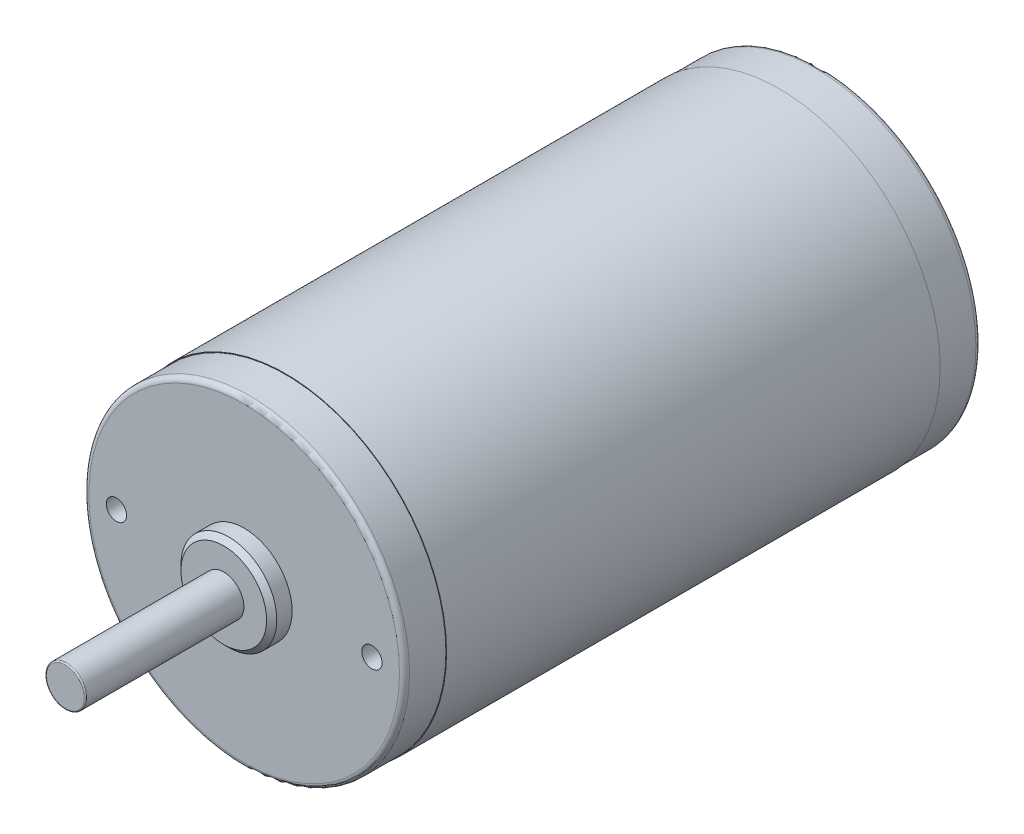
ISO-10303-21;
HEADER;
FILE_DESCRIPTION(('STEP AP214'),'2;1');
FILE_NAME('part.step','',(''),(''),'','','');
FILE_SCHEMA(('AUTOMOTIVE_DESIGN { 1 0 10303 214 1 1 1 1 }'));
ENDSEC;
DATA;
#1=APPLICATION_CONTEXT('core data for automotive mechanical design processes');
#2=APPLICATION_PROTOCOL_DEFINITION('international standard','automotive_design',2000,#1);
#3=PRODUCT_CONTEXT('',#1,'mechanical');
#4=PRODUCT('Part','Part','',(#3));
#5=PRODUCT_RELATED_PRODUCT_CATEGORY('part','',(#4));
#6=PRODUCT_DEFINITION_FORMATION('','',#4);
#7=PRODUCT_DEFINITION_CONTEXT('part definition',#1,'design');
#8=PRODUCT_DEFINITION('design','',#6,#7);
#9=PRODUCT_DEFINITION_SHAPE('','',#8);
#10=(LENGTH_UNIT() NAMED_UNIT(*) SI_UNIT(.MILLI.,.METRE.));
#11=(NAMED_UNIT(*) PLANE_ANGLE_UNIT() SI_UNIT($,.RADIAN.));
#12=(NAMED_UNIT(*) SI_UNIT($,.STERADIAN.) SOLID_ANGLE_UNIT());
#13=UNCERTAINTY_MEASURE_WITH_UNIT(LENGTH_MEASURE(1.E-05),#10,'distance_accuracy_value','');
#14=(GEOMETRIC_REPRESENTATION_CONTEXT(3) GLOBAL_UNCERTAINTY_ASSIGNED_CONTEXT((#13)) GLOBAL_UNIT_ASSIGNED_CONTEXT((#10,
#11,#12)) REPRESENTATION_CONTEXT('',''));
#15=CARTESIAN_POINT('',(0.,0.,0.));
#16=DIRECTION('',(0.,0.,1.));
#17=DIRECTION('',(1.,0.,0.));
#18=AXIS2_PLACEMENT_3D('',#15,#16,#17);
#19=CARTESIAN_POINT('',(35.56,109.2962,-95.554799999998));
#20=DIRECTION('',(0.,0.,-1.));
#21=DIRECTION('',(-1.,0.,0.));
#22=AXIS2_PLACEMENT_3D('',#19,#20,#21);
#23=PLANE('',#22);
#24=CARTESIAN_POINT('',(35.56,109.2962,-95.554799999998));
#25=DIRECTION('',(0.,0.,-1.));
#26=DIRECTION('',(-1.,0.,0.));
#27=AXIS2_PLACEMENT_3D('',#24,#25,#26);
#28=CIRCLE('',#27,30.8770000000005);
#29=CARTESIAN_POINT('',(4.6829999999995,109.2962,-95.554799999998));
#30=VERTEX_POINT('',#29);
#31=EDGE_CURVE('E126',#30,#30,#28,.T.);
#32=ORIENTED_EDGE('',*,*,#31,.T.);
#33=EDGE_LOOP('',(#32));
#34=FACE_BOUND('',#33,.T.);
#35=CARTESIAN_POINT('',(35.56,109.2962,-95.554799999998));
#36=DIRECTION('',(0.,0.,-1.));
#37=DIRECTION('',(-1.,0.,0.));
#38=AXIS2_PLACEMENT_3D('',#35,#36,#37);
#39=CIRCLE('',#38,15.0368000000003);
#40=CARTESIAN_POINT('',(20.5231999999997,109.2962,-95.554799999998));
#41=VERTEX_POINT('',#40);
#42=EDGE_CURVE('E83',#41,#41,#39,.T.);
#43=ORIENTED_EDGE('',*,*,#42,.F.);
#44=EDGE_LOOP('',(#43));
#45=FACE_BOUND('',#44,.T.);
#46=ADVANCED_FACE('F40',(#34,#45),#23,.T.);
#47=CARTESIAN_POINT('',(35.56,109.2962,-87.325199999998));
#48=DIRECTION('',(0.,0.,-1.));
#49=DIRECTION('',(-1.,0.,0.));
#50=AXIS2_PLACEMENT_3D('',#47,#48,#49);
#51=PLANE('',#50);
#52=CARTESIAN_POINT('',(35.56,109.2962,-87.325199999998));
#53=DIRECTION('',(0.,0.,-1.));
#54=DIRECTION('',(-1.,0.,0.));
#55=AXIS2_PLACEMENT_3D('',#52,#53,#54);
#56=CIRCLE('',#55,32.0040000000005);
#57=CARTESIAN_POINT('',(3.5559999999995,109.2962,-87.325199999998));
#58=VERTEX_POINT('',#57);
#59=EDGE_CURVE('E98',#58,#58,#56,.T.);
#60=ORIENTED_EDGE('',*,*,#59,.T.);
#61=EDGE_LOOP('',(#60));
#62=FACE_BOUND('',#61,.T.);
#63=CARTESIAN_POINT('',(35.56,109.2962,-87.325199999998));
#64=DIRECTION('',(0.,0.,-1.));
#65=DIRECTION('',(-1.,0.,0.));
#66=AXIS2_PLACEMENT_3D('',#63,#64,#65);
#67=CIRCLE('',#66,31.8770000000005);
#68=CARTESIAN_POINT('',(3.6829999999995,109.2962,-87.325199999998));
#69=VERTEX_POINT('',#68);
#70=EDGE_CURVE('E86',#69,#69,#67,.T.);
#71=ORIENTED_EDGE('',*,*,#70,.F.);
#72=EDGE_LOOP('',(#71));
#73=FACE_BOUND('',#72,.T.);
#74=ADVANCED_FACE('F157',(#62,#73),#51,.T.);
#75=CARTESIAN_POINT('',(35.56,109.2962,23.114));
#76=DIRECTION('',(0.,0.,1.));
#77=DIRECTION('',(1.,0.,0.));
#78=AXIS2_PLACEMENT_3D('',#75,#76,#77);
#79=PLANE('',#78);
#80=CARTESIAN_POINT('',(35.56,109.2962,23.114));
#81=DIRECTION('',(0.,0.,1.));
#82=DIRECTION('',(1.,0.,0.));
#83=AXIS2_PLACEMENT_3D('',#80,#81,#82);
#84=CIRCLE('',#83,8.50900000182338);
#85=CARTESIAN_POINT('',(44.0690000018234,109.2962,23.114));
#86=VERTEX_POINT('',#85);
#87=EDGE_CURVE('E114',#86,#86,#84,.T.);
#88=ORIENTED_EDGE('',*,*,#87,.T.);
#89=EDGE_LOOP('',(#88));
#90=FACE_BOUND('',#89,.T.);
#91=CARTESIAN_POINT('',(35.56,109.2962,23.114));
#92=DIRECTION('',(0.,0.,1.));
#93=DIRECTION('',(1.,0.,0.));
#94=AXIS2_PLACEMENT_3D('',#91,#92,#93);
#95=CIRCLE('',#94,4.00000000000007);
#96=CARTESIAN_POINT('',(39.5600000000001,109.2962,23.114));
#97=VERTEX_POINT('',#96);
#98=EDGE_CURVE('E90',#97,#97,#95,.T.);
#99=ORIENTED_EDGE('',*,*,#98,.F.);
#100=EDGE_LOOP('',(#99));
#101=FACE_BOUND('',#100,.T.);
#102=ADVANCED_FACE('F163',(#90,#101),#79,.T.);
#103=CARTESIAN_POINT('',(67.5640000000005,109.2962,10.8204000000007));
#104=DIRECTION('',(0.,0.,1.));
#105=DIRECTION('',(1.,0.,0.));
#106=AXIS2_PLACEMENT_3D('',#103,#104,#105);
#107=PLANE('',#106);
#108=CARTESIAN_POINT('',(35.56,109.2962,10.8204000000007));
#109=DIRECTION('',(0.,0.,-1.));
#110=DIRECTION('',(-1.,0.,0.));
#111=AXIS2_PLACEMENT_3D('',#108,#109,#110);
#112=CIRCLE('',#111,32.0040000000005);
#113=CARTESIAN_POINT('',(3.5559999999995,109.2962,10.8204000000007));
#114=VERTEX_POINT('',#113);
#115=EDGE_CURVE('E102',#114,#114,#112,.T.);
#116=ORIENTED_EDGE('',*,*,#115,.F.);
#117=EDGE_LOOP('',(#116));
#118=FACE_BOUND('',#117,.T.);
#119=CARTESIAN_POINT('',(35.56,109.2962,10.8204000000007));
#120=DIRECTION('',(0.,0.,1.));
#121=DIRECTION('',(1.,0.,0.));
#122=AXIS2_PLACEMENT_3D('',#119,#120,#121);
#123=CIRCLE('',#122,31.8770000000005);
#124=CARTESIAN_POINT('',(67.4370000000005,109.2962,10.8204000000007));
#125=VERTEX_POINT('',#124);
#126=EDGE_CURVE('E94',#125,#125,#123,.T.);
#127=ORIENTED_EDGE('',*,*,#126,.F.);
#128=EDGE_LOOP('',(#127));
#129=FACE_BOUND('',#128,.T.);
#130=ADVANCED_FACE('F186',(#118,#129),#107,.T.);
#131=CARTESIAN_POINT('',(35.56,109.2962,10.8204000000007));
#132=DIRECTION('',(0.,0.,-1.));
#133=DIRECTION('',(-1.,0.,0.));
#134=AXIS2_PLACEMENT_3D('',#131,#132,#133);
#135=CYLINDRICAL_SURFACE('',#134,32.0040000000005);
#136=ORIENTED_EDGE('',*,*,#115,.T.);
#137=EDGE_LOOP('',(#136));
#138=FACE_BOUND('',#137,.T.);
#139=ORIENTED_EDGE('',*,*,#59,.F.);
#140=EDGE_LOOP('',(#139));
#141=FACE_BOUND('',#140,.T.);
#142=ADVANCED_FACE('F197',(#138,#141),#135,.T.);
#143=CARTESIAN_POINT('',(35.56,109.2962,19.05));
#144=DIRECTION('',(0.,0.,-1.));
#145=DIRECTION('',(-1.,0.,0.));
#146=AXIS2_PLACEMENT_3D('',#143,#144,#145);
#147=CYLINDRICAL_SURFACE('',#146,31.8770000000005);
#148=CARTESIAN_POINT('',(35.56,109.2962,18.05));
#149=DIRECTION('',(0.,0.,1.));
#150=DIRECTION('',(1.,0.,0.));
#151=AXIS2_PLACEMENT_3D('',#148,#149,#150);
#152=CIRCLE('',#151,31.8770000000005);
#153=CARTESIAN_POINT('',(67.4370000000005,109.2962,18.05));
#154=VERTEX_POINT('',#153);
#155=EDGE_CURVE('E138',#154,#154,#152,.F.);
#156=ORIENTED_EDGE('',*,*,#155,.T.);
#157=EDGE_LOOP('',(#156));
#158=FACE_BOUND('',#157,.T.);
#159=ORIENTED_EDGE('',*,*,#126,.T.);
#160=EDGE_LOOP('',(#159));
#161=FACE_BOUND('',#160,.T.);
#162=ADVANCED_FACE('F194',(#158,#161),#147,.T.);
#163=CARTESIAN_POINT('',(35.56,109.2962,19.05));
#164=DIRECTION('',(0.,0.,1.));
#165=DIRECTION('',(1.,0.,0.));
#166=AXIS2_PLACEMENT_3D('',#163,#164,#165);
#167=PLANE('',#166);
#168=CARTESIAN_POINT('',(35.56,109.2962,19.05));
#169=DIRECTION('',(0.,0.,1.));
#170=DIRECTION('',(1.,0.,0.));
#171=AXIS2_PLACEMENT_3D('',#168,#169,#170);
#172=CIRCLE('',#171,30.8770000000005);
#173=CARTESIAN_POINT('',(66.4370000000005,109.2962,19.05));
#174=VERTEX_POINT('',#173);
#175=EDGE_CURVE('E134',#174,#174,#172,.T.);
#176=ORIENTED_EDGE('',*,*,#175,.T.);
#177=EDGE_LOOP('',(#176));
#178=FACE_BOUND('',#177,.T.);
#179=CARTESIAN_POINT('',(10.1599999999994,109.2962,19.05));
#180=DIRECTION('',(0.,0.,1.));
#181=DIRECTION('',(1.,0.,0.));
#182=AXIS2_PLACEMENT_3D('',#179,#180,#181);
#183=CIRCLE('',#182,2.01930000000003);
#184=CARTESIAN_POINT('',(12.1792999999994,109.2962,19.05));
#185=VERTEX_POINT('',#184);
#186=EDGE_CURVE('E69',#185,#185,#183,.T.);
#187=ORIENTED_EDGE('',*,*,#186,.F.);
#188=EDGE_LOOP('',(#187));
#189=FACE_BOUND('',#188,.T.);
#190=CARTESIAN_POINT('',(60.96,109.2962,19.05));
#191=DIRECTION('',(0.,0.,1.));
#192=DIRECTION('',(1.,0.,0.));
#193=AXIS2_PLACEMENT_3D('',#190,#191,#192);
#194=CIRCLE('',#193,2.01930000000003);
#195=CARTESIAN_POINT('',(62.9793,109.2962,19.05));
#196=VERTEX_POINT('',#195);
#197=EDGE_CURVE('E68',#196,#196,#194,.T.);
#198=ORIENTED_EDGE('',*,*,#197,.F.);
#199=EDGE_LOOP('',(#198));
#200=FACE_BOUND('',#199,.T.);
#201=CARTESIAN_POINT('',(35.56,109.2962,19.05));
#202=DIRECTION('',(0.,0.,1.));
#203=DIRECTION('',(1.,0.,0.));
#204=AXIS2_PLACEMENT_3D('',#201,#202,#203);
#205=CIRCLE('',#204,9.52500000000019);
#206=CARTESIAN_POINT('',(45.0850000000002,109.2962,19.05));
#207=VERTEX_POINT('',#206);
#208=EDGE_CURVE('E106',#207,#207,#205,.T.);
#209=ORIENTED_EDGE('',*,*,#208,.F.);
#210=EDGE_LOOP('',(#209));
#211=FACE_BOUND('',#210,.T.);
#212=ADVANCED_FACE('F190',(#178,#189,#200,#211),#167,.T.);
#213=CARTESIAN_POINT('',(35.56,109.2962,23.114));
#214=DIRECTION('',(0.,0.,-1.));
#215=DIRECTION('',(-1.,0.,0.));
#216=AXIS2_PLACEMENT_3D('',#213,#214,#215);
#217=CYLINDRICAL_SURFACE('',#216,9.52500000000019);
#218=CARTESIAN_POINT('',(35.56,109.2962,22.0979999999996));
#219=DIRECTION('',(0.,0.,1.));
#220=DIRECTION('',(1.,0.,0.));
#221=AXIS2_PLACEMENT_3D('',#218,#219,#220);
#222=CIRCLE('',#221,9.52500000000019);
#223=CARTESIAN_POINT('',(45.0850000000002,109.2962,22.0979999999996));
#224=VERTEX_POINT('',#223);
#225=EDGE_CURVE('E110',#224,#224,#222,.F.);
#226=ORIENTED_EDGE('',*,*,#225,.T.);
#227=EDGE_LOOP('',(#226));
#228=FACE_BOUND('',#227,.T.);
#229=ORIENTED_EDGE('',*,*,#208,.T.);
#230=EDGE_LOOP('',(#229));
#231=FACE_BOUND('',#230,.T.);
#232=ADVANCED_FACE('F182',(#228,#231),#217,.T.);
#233=CARTESIAN_POINT('',(35.56,109.2962,54.614));
#234=DIRECTION('',(0.,0.,-1.));
#235=DIRECTION('',(-1.,0.,0.));
#236=AXIS2_PLACEMENT_3D('',#233,#234,#235);
#237=CYLINDRICAL_SURFACE('',#236,4.00000000000007);
#238=CARTESIAN_POINT('',(35.56,109.2962,54.36));
#239=DIRECTION('',(0.,0.,1.));
#240=DIRECTION('',(1.,0.,0.));
#241=AXIS2_PLACEMENT_3D('',#238,#239,#240);
#242=CIRCLE('',#241,4.00000000000007);
#243=CARTESIAN_POINT('',(39.5600000000001,109.2962,54.36));
#244=VERTEX_POINT('',#243);
#245=EDGE_CURVE('E122',#244,#244,#242,.F.);
#246=ORIENTED_EDGE('',*,*,#245,.T.);
#247=EDGE_LOOP('',(#246));
#248=FACE_BOUND('',#247,.T.);
#249=ORIENTED_EDGE('',*,*,#98,.T.);
#250=EDGE_LOOP('',(#249));
#251=FACE_BOUND('',#250,.T.);
#252=ADVANCED_FACE('F178',(#248,#251),#237,.T.);
#253=CARTESIAN_POINT('',(35.56,109.2962,54.614));
#254=DIRECTION('',(0.,0.,1.));
#255=DIRECTION('',(1.,0.,0.));
#256=AXIS2_PLACEMENT_3D('',#253,#254,#255);
#257=PLANE('',#256);
#258=CARTESIAN_POINT('',(35.56,109.2962,54.614));
#259=DIRECTION('',(0.,0.,1.));
#260=DIRECTION('',(1.,0.,0.));
#261=AXIS2_PLACEMENT_3D('',#258,#259,#260);
#262=CIRCLE('',#261,3.74600000000007);
#263=CARTESIAN_POINT('',(39.3060000000001,109.2962,54.614));
#264=VERTEX_POINT('',#263);
#265=EDGE_CURVE('E118',#264,#264,#262,.T.);
#266=ORIENTED_EDGE('',*,*,#265,.T.);
#267=EDGE_LOOP('',(#266));
#268=FACE_BOUND('',#267,.T.);
#269=ADVANCED_FACE('F174',(#268),#257,.T.);
#270=CARTESIAN_POINT('',(35.56,109.2962,-95.554799999998));
#271=DIRECTION('',(0.,0.,1.));
#272=DIRECTION('',(1.,0.,0.));
#273=AXIS2_PLACEMENT_3D('',#270,#271,#272);
#274=CYLINDRICAL_SURFACE('',#273,31.8770000000005);
#275=CARTESIAN_POINT('',(35.56,109.2962,-94.554799999998));
#276=DIRECTION('',(0.,0.,-1.));
#277=DIRECTION('',(-1.,0.,0.));
#278=AXIS2_PLACEMENT_3D('',#275,#276,#277);
#279=CIRCLE('',#278,31.8770000000005);
#280=CARTESIAN_POINT('',(3.6829999999995,109.2962,-94.554799999998));
#281=VERTEX_POINT('',#280);
#282=EDGE_CURVE('E130',#281,#281,#279,.F.);
#283=ORIENTED_EDGE('',*,*,#282,.T.);
#284=EDGE_LOOP('',(#283));
#285=FACE_BOUND('',#284,.T.);
#286=ORIENTED_EDGE('',*,*,#70,.T.);
#287=EDGE_LOOP('',(#286));
#288=FACE_BOUND('',#287,.T.);
#289=ADVANCED_FACE('F171',(#285,#288),#274,.T.);
#290=CARTESIAN_POINT('',(35.56,109.2962,-100.317299999998));
#291=DIRECTION('',(0.,0.,1.));
#292=DIRECTION('',(1.,0.,0.));
#293=AXIS2_PLACEMENT_3D('',#290,#291,#292);
#294=CYLINDRICAL_SURFACE('',#293,15.0368000000003);
#295=CARTESIAN_POINT('',(35.56,109.2962,-99.317299999998));
#296=DIRECTION('',(0.,0.,-1.));
#297=DIRECTION('',(-1.,0.,0.));
#298=AXIS2_PLACEMENT_3D('',#295,#296,#297);
#299=CIRCLE('',#298,15.0368000000003);
#300=CARTESIAN_POINT('',(20.5231999999997,109.2962,-99.317299999998));
#301=VERTEX_POINT('',#300);
#302=EDGE_CURVE('E11',#301,#301,#299,.F.);
#303=ORIENTED_EDGE('',*,*,#302,.T.);
#304=EDGE_LOOP('',(#303));
#305=FACE_BOUND('',#304,.T.);
#306=ORIENTED_EDGE('',*,*,#42,.T.);
#307=EDGE_LOOP('',(#306));
#308=FACE_BOUND('',#307,.T.);
#309=ADVANCED_FACE('F169',(#305,#308),#294,.T.);
#310=CARTESIAN_POINT('',(35.56,109.2962,-100.317299999998));
#311=DIRECTION('',(0.,0.,-1.));
#312=DIRECTION('',(-1.,0.,0.));
#313=AXIS2_PLACEMENT_3D('',#310,#311,#312);
#314=PLANE('',#313);
#315=CARTESIAN_POINT('',(35.56,109.2962,-100.317299999998));
#316=DIRECTION('',(0.,0.,-1.));
#317=DIRECTION('',(-1.,0.,0.));
#318=AXIS2_PLACEMENT_3D('',#315,#316,#317);
#319=CIRCLE('',#318,14.0368000000003);
#320=CARTESIAN_POINT('',(21.5231999999997,109.2962,-100.317299999998));
#321=VERTEX_POINT('',#320);
#322=EDGE_CURVE('E49',#321,#321,#319,.T.);
#323=ORIENTED_EDGE('',*,*,#322,.T.);
#324=EDGE_LOOP('',(#323));
#325=FACE_BOUND('',#324,.T.);
#326=ADVANCED_FACE('F145',(#325),#314,.T.);
#327=CARTESIAN_POINT('',(60.96,109.2962,5.43560000000074));
#328=DIRECTION('',(0.,0.,1.));
#329=DIRECTION('',(1.,0.,0.));
#330=AXIS2_PLACEMENT_3D('',#327,#328,#329);
#331=CONICAL_SURFACE('',#330,2.01930000000003,1.0297442575);
#332=CARTESIAN_POINT('',(60.96,109.2962,4.22228214876452));
#333=VERTEX_POINT('',#332);
#334=VERTEX_LOOP('',#333);
#335=FACE_BOUND('',#334,.T.);
#336=CARTESIAN_POINT('',(60.96,109.2962,5.43560000000074));
#337=DIRECTION('',(0.,0.,1.));
#338=DIRECTION('',(1.,0.,0.));
#339=AXIS2_PLACEMENT_3D('',#336,#337,#338);
#340=CIRCLE('',#339,2.01930000000003);
#341=CARTESIAN_POINT('',(62.9793,109.2962,5.43560000000074));
#342=VERTEX_POINT('',#341);
#343=EDGE_CURVE('E75',#342,#342,#340,.T.);
#344=ORIENTED_EDGE('',*,*,#343,.T.);
#345=EDGE_LOOP('',(#344));
#346=FACE_BOUND('',#345,.T.);
#347=ADVANCED_FACE('F263',(#335,#346),#331,.F.);
#348=CARTESIAN_POINT('',(60.96,109.2962,19.05));
#349=DIRECTION('',(0.,0.,1.));
#350=DIRECTION('',(1.,0.,0.));
#351=AXIS2_PLACEMENT_3D('',#348,#349,#350);
#352=CYLINDRICAL_SURFACE('',#351,2.01930000000003);
#353=ORIENTED_EDGE('',*,*,#343,.F.);
#354=EDGE_LOOP('',(#353));
#355=FACE_BOUND('',#354,.T.);
#356=ORIENTED_EDGE('',*,*,#197,.T.);
#357=EDGE_LOOP('',(#356));
#358=FACE_BOUND('',#357,.T.);
#359=ADVANCED_FACE('F61',(#355,#358),#352,.F.);
#360=CARTESIAN_POINT('',(10.1599999999994,109.2962,5.4356000000007));
#361=DIRECTION('',(0.,0.,1.));
#362=DIRECTION('',(1.,0.,0.));
#363=AXIS2_PLACEMENT_3D('',#360,#361,#362);
#364=CONICAL_SURFACE('',#363,2.01930000000003,1.0297442575);
#365=CARTESIAN_POINT('',(10.1599999999994,109.2962,4.22228214876447));
#366=VERTEX_POINT('',#365);
#367=VERTEX_LOOP('',#366);
#368=FACE_BOUND('',#367,.T.);
#369=CARTESIAN_POINT('',(10.1599999999994,109.2962,5.4356000000007));
#370=DIRECTION('',(0.,0.,1.));
#371=DIRECTION('',(1.,0.,0.));
#372=AXIS2_PLACEMENT_3D('',#369,#370,#371);
#373=CIRCLE('',#372,2.01930000000003);
#374=CARTESIAN_POINT('',(12.1792999999994,109.2962,5.4356000000007));
#375=VERTEX_POINT('',#374);
#376=EDGE_CURVE('E65',#375,#375,#373,.T.);
#377=ORIENTED_EDGE('',*,*,#376,.T.);
#378=EDGE_LOOP('',(#377));
#379=FACE_BOUND('',#378,.T.);
#380=ADVANCED_FACE('F57',(#368,#379),#364,.F.);
#381=CARTESIAN_POINT('',(10.1599999999994,109.2962,19.05));
#382=DIRECTION('',(0.,0.,1.));
#383=DIRECTION('',(1.,0.,0.));
#384=AXIS2_PLACEMENT_3D('',#381,#382,#383);
#385=CYLINDRICAL_SURFACE('',#384,2.01930000000003);
#386=ORIENTED_EDGE('',*,*,#376,.F.);
#387=EDGE_LOOP('',(#386));
#388=FACE_BOUND('',#387,.T.);
#389=ORIENTED_EDGE('',*,*,#186,.T.);
#390=EDGE_LOOP('',(#389));
#391=FACE_BOUND('',#390,.T.);
#392=ADVANCED_FACE('F60',(#388,#391),#385,.F.);
#393=CARTESIAN_POINT('',(35.56,109.2962,22.0979999999996));
#394=DIRECTION('',(0.,0.,-1.));
#395=DIRECTION('',(-1.,0.,0.));
#396=AXIS2_PLACEMENT_3D('',#393,#394,#395);
#397=CONICAL_SURFACE('',#396,9.52500000000019,0.785398162500005);
#398=ORIENTED_EDGE('',*,*,#87,.F.);
#399=EDGE_LOOP('',(#398));
#400=FACE_BOUND('',#399,.T.);
#401=ORIENTED_EDGE('',*,*,#225,.F.);
#402=EDGE_LOOP('',(#401));
#403=FACE_BOUND('',#402,.T.);
#404=ADVANCED_FACE('F206',(#400,#403),#397,.T.);
#405=CARTESIAN_POINT('',(35.56,109.2962,54.36));
#406=DIRECTION('',(0.,0.,1.));
#407=DIRECTION('',(1.,0.,0.));
#408=AXIS2_PLACEMENT_3D('',#405,#406,#407);
#409=TOROIDAL_SURFACE('',#408,3.74600000000007,0.254);
#410=ORIENTED_EDGE('',*,*,#245,.F.);
#411=EDGE_LOOP('',(#410));
#412=FACE_BOUND('',#411,.T.);
#413=ORIENTED_EDGE('',*,*,#265,.F.);
#414=EDGE_LOOP('',(#413));
#415=FACE_BOUND('',#414,.T.);
#416=ADVANCED_FACE('F209',(#412,#415),#409,.T.);
#417=CARTESIAN_POINT('',(35.56,109.2962,-94.554799999998));
#418=DIRECTION('',(0.,0.,-1.));
#419=DIRECTION('',(-1.,0.,0.));
#420=AXIS2_PLACEMENT_3D('',#417,#418,#419);
#421=TOROIDAL_SURFACE('',#420,30.8770000000005,1.);
#422=ORIENTED_EDGE('',*,*,#282,.F.);
#423=EDGE_LOOP('',(#422));
#424=FACE_BOUND('',#423,.T.);
#425=ORIENTED_EDGE('',*,*,#31,.F.);
#426=EDGE_LOOP('',(#425));
#427=FACE_BOUND('',#426,.T.);
#428=ADVANCED_FACE('F153',(#424,#427),#421,.T.);
#429=CARTESIAN_POINT('',(35.56,109.2962,18.05));
#430=DIRECTION('',(0.,0.,1.));
#431=DIRECTION('',(1.,0.,0.));
#432=AXIS2_PLACEMENT_3D('',#429,#430,#431);
#433=TOROIDAL_SURFACE('',#432,30.8770000000005,1.);
#434=ORIENTED_EDGE('',*,*,#155,.F.);
#435=EDGE_LOOP('',(#434));
#436=FACE_BOUND('',#435,.T.);
#437=ORIENTED_EDGE('',*,*,#175,.F.);
#438=EDGE_LOOP('',(#437));
#439=FACE_BOUND('',#438,.T.);
#440=ADVANCED_FACE('F148',(#436,#439),#433,.T.);
#441=CARTESIAN_POINT('',(35.56,109.2962,-99.317299999998));
#442=DIRECTION('',(0.,0.,-1.));
#443=DIRECTION('',(-1.,0.,0.));
#444=AXIS2_PLACEMENT_3D('',#441,#442,#443);
#445=TOROIDAL_SURFACE('',#444,14.0368000000003,1.);
#446=ORIENTED_EDGE('',*,*,#302,.F.);
#447=EDGE_LOOP('',(#446));
#448=FACE_BOUND('',#447,.T.);
#449=ORIENTED_EDGE('',*,*,#322,.F.);
#450=EDGE_LOOP('',(#449));
#451=FACE_BOUND('',#450,.T.);
#452=ADVANCED_FACE('F42',(#448,#451),#445,.T.);
#453=CLOSED_SHELL('',(#46,#74,#102,#130,#142,#162,#212,#232,#252,#269,#289,#309,#326,#347,#359,
#380,#392,#404,#416,#428,#440,#452));
#454=MANIFOLD_SOLID_BREP('B2',#453);
#455=ADVANCED_BREP_SHAPE_REPRESENTATION('',(#18,#454),#14);
#456=SHAPE_DEFINITION_REPRESENTATION(#9,#455);
ENDSEC;
END-ISO-10303-21;
